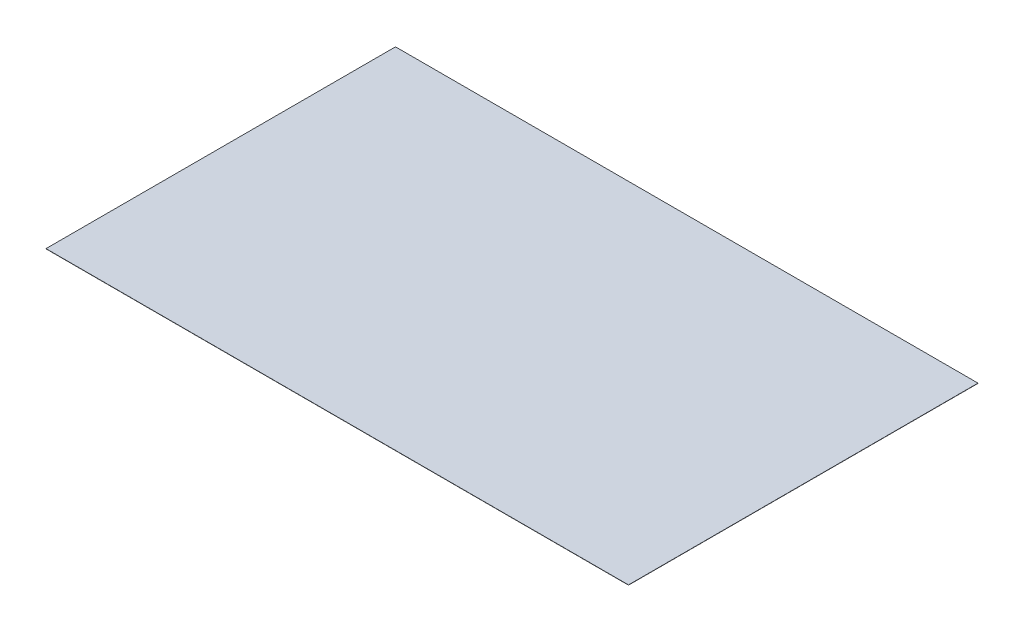
ISO-10303-21;
HEADER;
FILE_DESCRIPTION(('STEP AP214'),'2;1');
FILE_NAME('part.step','',(''),(''),'','','');
FILE_SCHEMA(('AUTOMOTIVE_DESIGN { 1 0 10303 214 1 1 1 1 }'));
ENDSEC;
DATA;
#1=APPLICATION_CONTEXT('core data for automotive mechanical design processes');
#2=APPLICATION_PROTOCOL_DEFINITION('international standard','automotive_design',2000,#1);
#3=PRODUCT_CONTEXT('',#1,'mechanical');
#4=PRODUCT('Part','Part','',(#3));
#5=PRODUCT_RELATED_PRODUCT_CATEGORY('part','',(#4));
#6=PRODUCT_DEFINITION_FORMATION('','',#4);
#7=PRODUCT_DEFINITION_CONTEXT('part definition',#1,'design');
#8=PRODUCT_DEFINITION('design','',#6,#7);
#9=PRODUCT_DEFINITION_SHAPE('','',#8);
#10=(LENGTH_UNIT() NAMED_UNIT(*) SI_UNIT(.MILLI.,.METRE.));
#11=(NAMED_UNIT(*) PLANE_ANGLE_UNIT() SI_UNIT($,.RADIAN.));
#12=(NAMED_UNIT(*) SI_UNIT($,.STERADIAN.) SOLID_ANGLE_UNIT());
#13=UNCERTAINTY_MEASURE_WITH_UNIT(LENGTH_MEASURE(1.E-05),#10,'distance_accuracy_value','');
#14=(GEOMETRIC_REPRESENTATION_CONTEXT(3) GLOBAL_UNCERTAINTY_ASSIGNED_CONTEXT((#13)) GLOBAL_UNIT_ASSIGNED_CONTEXT((#10,
#11,#12)) REPRESENTATION_CONTEXT('',''));
#15=CARTESIAN_POINT('',(0.,0.,0.));
#16=DIRECTION('',(0.,0.,1.));
#17=DIRECTION('',(1.,0.,0.));
#18=AXIS2_PLACEMENT_3D('',#15,#16,#17);
#19=CARTESIAN_POINT('',(0.,0.01,0.));
#20=DIRECTION('',(1.,0.,0.));
#21=DIRECTION('',(0.,0.,-1.));
#22=AXIS2_PLACEMENT_3D('',#19,#20,#21);
#23=PLANE('',#22);
#24=DIRECTION('',(0.,0.,1.));
#25=VECTOR('',#24,1.);
#26=CARTESIAN_POINT('',(0.,0.,0.));
#27=LINE('',#26,#25);
#28=CARTESIAN_POINT('',(0.,0.,-15.));
#29=VERTEX_POINT('',#28);
#30=CARTESIAN_POINT('',(0.,0.,0.));
#31=VERTEX_POINT('',#30);
#32=EDGE_CURVE('E98',#29,#31,#27,.T.);
#33=ORIENTED_EDGE('',*,*,#32,.T.);
#34=DIRECTION('',(0.,-1.,0.));
#35=VECTOR('',#34,1.);
#36=CARTESIAN_POINT('',(0.,0.01,0.));
#37=LINE('',#36,#35);
#38=CARTESIAN_POINT('',(0.,0.01,0.));
#39=VERTEX_POINT('',#38);
#40=EDGE_CURVE('E11',#39,#31,#37,.T.);
#41=ORIENTED_EDGE('',*,*,#40,.F.);
#42=DIRECTION('',(0.,0.,1.));
#43=VECTOR('',#42,1.);
#44=CARTESIAN_POINT('',(0.,0.01,0.));
#45=LINE('',#44,#43);
#46=CARTESIAN_POINT('',(0.,0.01,-15.));
#47=VERTEX_POINT('',#46);
#48=EDGE_CURVE('E86',#47,#39,#45,.T.);
#49=ORIENTED_EDGE('',*,*,#48,.F.);
#50=DIRECTION('',(0.,-1.,0.));
#51=VECTOR('',#50,1.);
#52=CARTESIAN_POINT('',(0.,0.01,-15.));
#53=LINE('',#52,#51);
#54=EDGE_CURVE('E94',#47,#29,#53,.T.);
#55=ORIENTED_EDGE('',*,*,#54,.T.);
#56=EDGE_LOOP('',(#33,#41,#49,#55));
#57=FACE_BOUND('',#56,.T.);
#58=ADVANCED_FACE('F35',(#57),#23,.F.);
#59=CARTESIAN_POINT('',(0.,0.01,0.));
#60=DIRECTION('',(0.,0.,-1.));
#61=DIRECTION('',(-1.,0.,0.));
#62=AXIS2_PLACEMENT_3D('',#59,#60,#61);
#63=PLANE('',#62);
#64=DIRECTION('',(1.,0.,0.));
#65=VECTOR('',#64,1.);
#66=CARTESIAN_POINT('',(0.,0.,0.));
#67=LINE('',#66,#65);
#68=CARTESIAN_POINT('',(25.,0.,0.));
#69=VERTEX_POINT('',#68);
#70=EDGE_CURVE('E90',#31,#69,#67,.T.);
#71=ORIENTED_EDGE('',*,*,#70,.T.);
#72=DIRECTION('',(0.,-1.,0.));
#73=VECTOR('',#72,1.);
#74=CARTESIAN_POINT('',(25.,0.01,0.));
#75=LINE('',#74,#73);
#76=CARTESIAN_POINT('',(25.,0.01,0.));
#77=VERTEX_POINT('',#76);
#78=EDGE_CURVE('E43',#77,#69,#75,.T.);
#79=ORIENTED_EDGE('',*,*,#78,.F.);
#80=DIRECTION('',(1.,0.,0.));
#81=VECTOR('',#80,1.);
#82=CARTESIAN_POINT('',(0.,0.01,0.));
#83=LINE('',#82,#81);
#84=EDGE_CURVE('E81',#39,#77,#83,.T.);
#85=ORIENTED_EDGE('',*,*,#84,.F.);
#86=ORIENTED_EDGE('',*,*,#40,.T.);
#87=EDGE_LOOP('',(#71,#79,#85,#86));
#88=FACE_BOUND('',#87,.T.);
#89=ADVANCED_FACE('F89',(#88),#63,.F.);
#90=CARTESIAN_POINT('',(25.,0.01,0.));
#91=DIRECTION('',(-1.,0.,0.));
#92=DIRECTION('',(0.,0.,1.));
#93=AXIS2_PLACEMENT_3D('',#90,#91,#92);
#94=PLANE('',#93);
#95=DIRECTION('',(0.,0.,-1.));
#96=VECTOR('',#95,1.);
#97=CARTESIAN_POINT('',(25.,0.,0.));
#98=LINE('',#97,#96);
#99=CARTESIAN_POINT('',(25.,0.,-15.));
#100=VERTEX_POINT('',#99);
#101=EDGE_CURVE('E68',#69,#100,#98,.T.);
#102=ORIENTED_EDGE('',*,*,#101,.T.);
#103=DIRECTION('',(0.,-1.,0.));
#104=VECTOR('',#103,1.);
#105=CARTESIAN_POINT('',(25.,0.01,-15.));
#106=LINE('',#105,#104);
#107=CARTESIAN_POINT('',(25.,0.01,-15.));
#108=VERTEX_POINT('',#107);
#109=EDGE_CURVE('E91',#108,#100,#106,.T.);
#110=ORIENTED_EDGE('',*,*,#109,.F.);
#111=DIRECTION('',(0.,0.,-1.));
#112=VECTOR('',#111,1.);
#113=CARTESIAN_POINT('',(25.,0.01,0.));
#114=LINE('',#113,#112);
#115=EDGE_CURVE('E84',#77,#108,#114,.T.);
#116=ORIENTED_EDGE('',*,*,#115,.F.);
#117=ORIENTED_EDGE('',*,*,#78,.T.);
#118=EDGE_LOOP('',(#102,#110,#116,#117));
#119=FACE_BOUND('',#118,.T.);
#120=ADVANCED_FACE('F92',(#119),#94,.F.);
#121=CARTESIAN_POINT('',(0.,0.01,-15.));
#122=DIRECTION('',(0.,0.,1.));
#123=DIRECTION('',(1.,0.,0.));
#124=AXIS2_PLACEMENT_3D('',#121,#122,#123);
#125=PLANE('',#124);
#126=DIRECTION('',(-1.,0.,0.));
#127=VECTOR('',#126,1.);
#128=CARTESIAN_POINT('',(0.,0.,-15.));
#129=LINE('',#128,#127);
#130=EDGE_CURVE('E74',#100,#29,#129,.T.);
#131=ORIENTED_EDGE('',*,*,#130,.T.);
#132=ORIENTED_EDGE('',*,*,#54,.F.);
#133=DIRECTION('',(-1.,0.,0.));
#134=VECTOR('',#133,1.);
#135=CARTESIAN_POINT('',(0.,0.01,-15.));
#136=LINE('',#135,#134);
#137=EDGE_CURVE('E51',#108,#47,#136,.T.);
#138=ORIENTED_EDGE('',*,*,#137,.F.);
#139=ORIENTED_EDGE('',*,*,#109,.T.);
#140=EDGE_LOOP('',(#131,#132,#138,#139));
#141=FACE_BOUND('',#140,.T.);
#142=ADVANCED_FACE('F105',(#141),#125,.F.);
#143=CARTESIAN_POINT('',(0.,0.01,0.));
#144=DIRECTION('',(0.,-1.,0.));
#145=DIRECTION('',(0.,0.,-1.));
#146=AXIS2_PLACEMENT_3D('',#143,#144,#145);
#147=PLANE('',#146);
#148=ORIENTED_EDGE('',*,*,#48,.T.);
#149=ORIENTED_EDGE('',*,*,#84,.T.);
#150=ORIENTED_EDGE('',*,*,#115,.T.);
#151=ORIENTED_EDGE('',*,*,#137,.T.);
#152=EDGE_LOOP('',(#148,#149,#150,#151));
#153=FACE_BOUND('',#152,.T.);
#154=ADVANCED_FACE('F82',(#153),#147,.F.);
#155=CARTESIAN_POINT('',(0.,0.,0.));
#156=DIRECTION('',(0.,-1.,0.));
#157=DIRECTION('',(0.,0.,-1.));
#158=AXIS2_PLACEMENT_3D('',#155,#156,#157);
#159=PLANE('',#158);
#160=ORIENTED_EDGE('',*,*,#32,.F.);
#161=ORIENTED_EDGE('',*,*,#130,.F.);
#162=ORIENTED_EDGE('',*,*,#101,.F.);
#163=ORIENTED_EDGE('',*,*,#70,.F.);
#164=EDGE_LOOP('',(#160,#161,#162,#163));
#165=FACE_BOUND('',#164,.T.);
#166=ADVANCED_FACE('F108',(#165),#159,.T.);
#167=CLOSED_SHELL('',(#58,#89,#120,#142,#154,#166));
#168=MANIFOLD_SOLID_BREP('B2',#167);
#169=ADVANCED_BREP_SHAPE_REPRESENTATION('',(#18,#168),#14);
#170=SHAPE_DEFINITION_REPRESENTATION(#9,#169);
ENDSEC;
END-ISO-10303-21;
